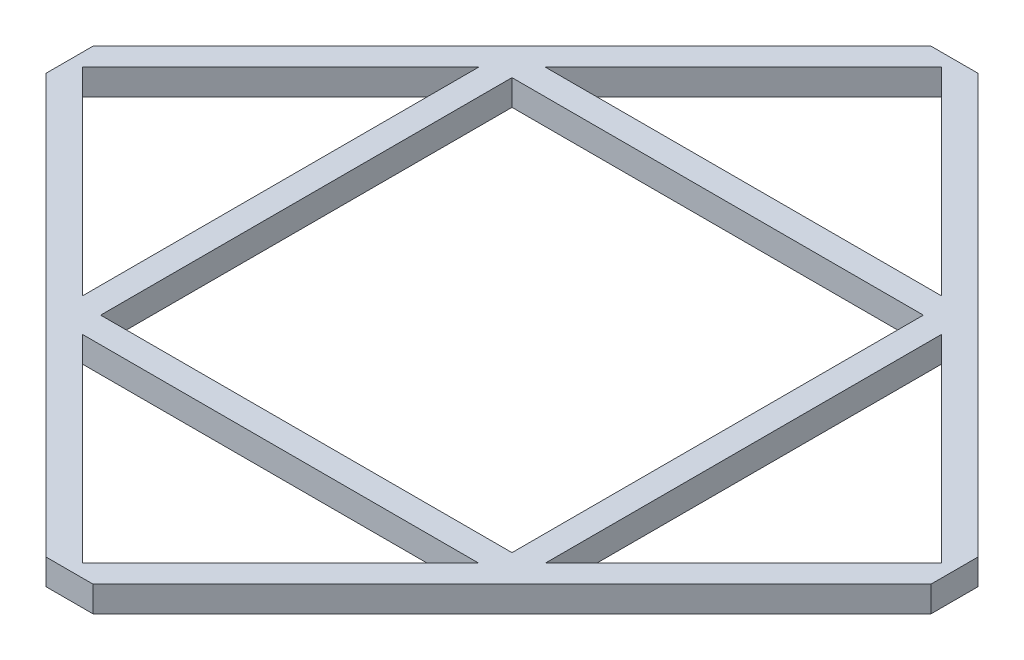
ISO-10303-21;
HEADER;
FILE_DESCRIPTION(('STEP AP214'),'2;1');
FILE_NAME('part.step','',(''),(''),'','','');
FILE_SCHEMA(('AUTOMOTIVE_DESIGN { 1 0 10303 214 1 1 1 1 }'));
ENDSEC;
DATA;
#1=APPLICATION_CONTEXT('core data for automotive mechanical design processes');
#2=APPLICATION_PROTOCOL_DEFINITION('international standard','automotive_design',2000,#1);
#3=PRODUCT_CONTEXT('',#1,'mechanical');
#4=PRODUCT('Part','Part','',(#3));
#5=PRODUCT_RELATED_PRODUCT_CATEGORY('part','',(#4));
#6=PRODUCT_DEFINITION_FORMATION('','',#4);
#7=PRODUCT_DEFINITION_CONTEXT('part definition',#1,'design');
#8=PRODUCT_DEFINITION('design','',#6,#7);
#9=PRODUCT_DEFINITION_SHAPE('','',#8);
#10=(LENGTH_UNIT() NAMED_UNIT(*) SI_UNIT(.MILLI.,.METRE.));
#11=(NAMED_UNIT(*) PLANE_ANGLE_UNIT() SI_UNIT($,.RADIAN.));
#12=(NAMED_UNIT(*) SI_UNIT($,.STERADIAN.) SOLID_ANGLE_UNIT());
#13=UNCERTAINTY_MEASURE_WITH_UNIT(LENGTH_MEASURE(1.E-05),#10,'distance_accuracy_value','');
#14=(GEOMETRIC_REPRESENTATION_CONTEXT(3) GLOBAL_UNCERTAINTY_ASSIGNED_CONTEXT((#13)) GLOBAL_UNIT_ASSIGNED_CONTEXT((#10,
#11,#12)) REPRESENTATION_CONTEXT('',''));
#15=CARTESIAN_POINT('',(0.,0.,0.));
#16=DIRECTION('',(0.,0.,1.));
#17=DIRECTION('',(1.,0.,0.));
#18=AXIS2_PLACEMENT_3D('',#15,#16,#17);
#19=CARTESIAN_POINT('',(-3618.34271247462,400.,-3618.34271247462));
#20=DIRECTION('',(-0.707106781186547,0.,-0.707106781186548));
#21=DIRECTION('',(-0.707106781186548,0.,0.707106781186547));
#22=AXIS2_PLACEMENT_3D('',#19,#20,#21);
#23=PLANE('',#22);
#24=DIRECTION('',(0.707106781186548,0.,-0.707106781186547));
#25=VECTOR('',#24,1.);
#26=CARTESIAN_POINT('',(-3618.34271247462,0.,-3618.34271247462));
#27=LINE('',#26,#25);
#28=CARTESIAN_POINT('',(-6871.,0.,-365.685424949239));
#29=VERTEX_POINT('',#28);
#30=CARTESIAN_POINT('',(-365.685424949248,0.,-6870.99999999999));
#31=VERTEX_POINT('',#30);
#32=EDGE_CURVE('E280',#29,#31,#27,.T.);
#33=ORIENTED_EDGE('',*,*,#32,.F.);
#34=DIRECTION('',(0.,-1.,0.));
#35=VECTOR('',#34,1.);
#36=CARTESIAN_POINT('',(-6871.,400.,-365.685424949239));
#37=LINE('',#36,#35);
#38=CARTESIAN_POINT('',(-6871.,400.,-365.685424949239));
#39=VERTEX_POINT('',#38);
#40=EDGE_CURVE('E11',#39,#29,#37,.T.);
#41=ORIENTED_EDGE('',*,*,#40,.F.);
#42=DIRECTION('',(0.707106781186548,0.,-0.707106781186547));
#43=VECTOR('',#42,1.);
#44=CARTESIAN_POINT('',(-3618.34271247462,400.,-3618.34271247462));
#45=LINE('',#44,#43);
#46=CARTESIAN_POINT('',(-365.685424949248,400.,-6870.99999999999));
#47=VERTEX_POINT('',#46);
#48=EDGE_CURVE('E474',#39,#47,#45,.T.);
#49=ORIENTED_EDGE('',*,*,#48,.T.);
#50=DIRECTION('',(0.,-1.,0.));
#51=VECTOR('',#50,1.);
#52=CARTESIAN_POINT('',(-365.685424949248,400.,-6870.99999999999));
#53=LINE('',#52,#51);
#54=EDGE_CURVE('E54',#47,#31,#53,.T.);
#55=ORIENTED_EDGE('',*,*,#54,.T.);
#56=EDGE_LOOP('',(#33,#41,#49,#55));
#57=FACE_BOUND('',#56,.T.);
#58=ADVANCED_FACE('F35',(#57),#23,.T.);
#59=CARTESIAN_POINT('',(-6871.,400.,1.66883159825324E-11));
#60=DIRECTION('',(1.,0.,0.));
#61=DIRECTION('',(0.,0.,-1.));
#62=AXIS2_PLACEMENT_3D('',#59,#60,#61);
#63=PLANE('',#62);
#64=DIRECTION('',(0.,0.,1.));
#65=VECTOR('',#64,1.);
#66=CARTESIAN_POINT('',(-6871.,0.,1.66883159825324E-11));
#67=LINE('',#66,#65);
#68=CARTESIAN_POINT('',(-6871.,0.,365.685424949242));
#69=VERTEX_POINT('',#68);
#70=EDGE_CURVE('E282',#29,#69,#67,.T.);
#71=ORIENTED_EDGE('',*,*,#70,.T.);
#72=DIRECTION('',(0.,-1.,0.));
#73=VECTOR('',#72,1.);
#74=CARTESIAN_POINT('',(-6871.,400.,365.685424949242));
#75=LINE('',#74,#73);
#76=CARTESIAN_POINT('',(-6871.,400.,365.685424949242));
#77=VERTEX_POINT('',#76);
#78=EDGE_CURVE('E45',#77,#69,#75,.T.);
#79=ORIENTED_EDGE('',*,*,#78,.F.);
#80=DIRECTION('',(0.,0.,1.));
#81=VECTOR('',#80,1.);
#82=CARTESIAN_POINT('',(-6871.,400.,1.66883159825324E-11));
#83=LINE('',#82,#81);
#84=EDGE_CURVE('E476',#39,#77,#83,.T.);
#85=ORIENTED_EDGE('',*,*,#84,.F.);
#86=ORIENTED_EDGE('',*,*,#40,.T.);
#87=EDGE_LOOP('',(#71,#79,#85,#86));
#88=FACE_BOUND('',#87,.T.);
#89=ADVANCED_FACE('F368',(#88),#63,.F.);
#90=CARTESIAN_POINT('',(-3618.34271247462,400.,3618.34271247462));
#91=DIRECTION('',(-0.707106781186548,0.,0.707106781186548));
#92=DIRECTION('',(0.707106781186548,0.,0.707106781186548));
#93=AXIS2_PLACEMENT_3D('',#90,#91,#92);
#94=PLANE('',#93);
#95=DIRECTION('',(-0.707106781186548,0.,-0.707106781186548));
#96=VECTOR('',#95,1.);
#97=CARTESIAN_POINT('',(-3618.34271247462,0.,3618.34271247462));
#98=LINE('',#97,#96);
#99=CARTESIAN_POINT('',(-365.685424949251,0.,6870.99999999999));
#100=VERTEX_POINT('',#99);
#101=EDGE_CURVE('E285',#100,#69,#98,.T.);
#102=ORIENTED_EDGE('',*,*,#101,.F.);
#103=DIRECTION('',(0.,-1.,0.));
#104=VECTOR('',#103,1.);
#105=CARTESIAN_POINT('',(-365.685424949251,400.,6870.99999999999));
#106=LINE('',#105,#104);
#107=CARTESIAN_POINT('',(-365.685424949251,400.,6870.99999999999));
#108=VERTEX_POINT('',#107);
#109=EDGE_CURVE('E308',#108,#100,#106,.T.);
#110=ORIENTED_EDGE('',*,*,#109,.F.);
#111=DIRECTION('',(-0.707106781186548,0.,-0.707106781186548));
#112=VECTOR('',#111,1.);
#113=CARTESIAN_POINT('',(-3618.34271247462,400.,3618.34271247462));
#114=LINE('',#113,#112);
#115=EDGE_CURVE('E478',#108,#77,#114,.T.);
#116=ORIENTED_EDGE('',*,*,#115,.T.);
#117=ORIENTED_EDGE('',*,*,#78,.T.);
#118=EDGE_LOOP('',(#102,#110,#116,#117));
#119=FACE_BOUND('',#118,.T.);
#120=ADVANCED_FACE('F373',(#119),#94,.T.);
#121=CARTESIAN_POINT('',(-8.34415799126599E-12,400.,6870.99999999999));
#122=DIRECTION('',(0.,0.,-1.));
#123=DIRECTION('',(-1.,0.,0.));
#124=AXIS2_PLACEMENT_3D('',#121,#122,#123);
#125=PLANE('',#124);
#126=DIRECTION('',(1.,0.,0.));
#127=VECTOR('',#126,1.);
#128=CARTESIAN_POINT('',(-8.34415799126599E-12,0.,6870.99999999999));
#129=LINE('',#128,#127);
#130=CARTESIAN_POINT('',(365.685424949249,0.,6870.99999999999));
#131=VERTEX_POINT('',#130);
#132=EDGE_CURVE('E288',#100,#131,#129,.T.);
#133=ORIENTED_EDGE('',*,*,#132,.T.);
#134=DIRECTION('',(0.,-1.,0.));
#135=VECTOR('',#134,1.);
#136=CARTESIAN_POINT('',(365.685424949249,400.,6870.99999999999));
#137=LINE('',#136,#135);
#138=CARTESIAN_POINT('',(365.685424949249,400.,6870.99999999999));
#139=VERTEX_POINT('',#138);
#140=EDGE_CURVE('E305',#139,#131,#137,.T.);
#141=ORIENTED_EDGE('',*,*,#140,.F.);
#142=DIRECTION('',(1.,0.,0.));
#143=VECTOR('',#142,1.);
#144=CARTESIAN_POINT('',(-8.34415799126599E-12,400.,6870.99999999999));
#145=LINE('',#144,#143);
#146=EDGE_CURVE('E227',#108,#139,#145,.T.);
#147=ORIENTED_EDGE('',*,*,#146,.F.);
#148=ORIENTED_EDGE('',*,*,#109,.T.);
#149=EDGE_LOOP('',(#133,#141,#147,#148));
#150=FACE_BOUND('',#149,.T.);
#151=ADVANCED_FACE('F484',(#150),#125,.F.);
#152=CARTESIAN_POINT('',(3618.34271247462,400.,3618.34271247462));
#153=DIRECTION('',(-0.707106781186547,0.,-0.707106781186548));
#154=DIRECTION('',(-0.707106781186548,0.,0.707106781186547));
#155=AXIS2_PLACEMENT_3D('',#152,#153,#154);
#156=PLANE('',#155);
#157=DIRECTION('',(0.707106781186548,0.,-0.707106781186547));
#158=VECTOR('',#157,1.);
#159=CARTESIAN_POINT('',(3618.34271247462,0.,3618.34271247462));
#160=LINE('',#159,#158);
#161=CARTESIAN_POINT('',(6871.,0.,365.685424949239));
#162=VERTEX_POINT('',#161);
#163=EDGE_CURVE('E291',#131,#162,#160,.T.);
#164=ORIENTED_EDGE('',*,*,#163,.T.);
#165=DIRECTION('',(0.,-1.,0.));
#166=VECTOR('',#165,1.);
#167=CARTESIAN_POINT('',(6871.,400.,365.685424949239));
#168=LINE('',#167,#166);
#169=CARTESIAN_POINT('',(6871.,400.,365.685424949239));
#170=VERTEX_POINT('',#169);
#171=EDGE_CURVE('E213',#170,#162,#168,.T.);
#172=ORIENTED_EDGE('',*,*,#171,.F.);
#173=DIRECTION('',(0.707106781186548,0.,-0.707106781186547));
#174=VECTOR('',#173,1.);
#175=CARTESIAN_POINT('',(3618.34271247462,400.,3618.34271247462));
#176=LINE('',#175,#174);
#177=EDGE_CURVE('E224',#139,#170,#176,.T.);
#178=ORIENTED_EDGE('',*,*,#177,.F.);
#179=ORIENTED_EDGE('',*,*,#140,.T.);
#180=EDGE_LOOP('',(#164,#172,#178,#179));
#181=FACE_BOUND('',#180,.T.);
#182=ADVANCED_FACE('F487',(#181),#156,.F.);
#183=CARTESIAN_POINT('',(6871.,400.,-1.66883159825326E-11));
#184=DIRECTION('',(1.,0.,0.));
#185=DIRECTION('',(0.,0.,-1.));
#186=AXIS2_PLACEMENT_3D('',#183,#184,#185);
#187=PLANE('',#186);
#188=DIRECTION('',(0.,0.,1.));
#189=VECTOR('',#188,1.);
#190=CARTESIAN_POINT('',(6871.,0.,-1.66883159825326E-11));
#191=LINE('',#190,#189);
#192=CARTESIAN_POINT('',(6871.,0.,-365.685424949237));
#193=VERTEX_POINT('',#192);
#194=EDGE_CURVE('E210',#193,#162,#191,.T.);
#195=ORIENTED_EDGE('',*,*,#194,.F.);
#196=DIRECTION('',(0.,-1.,0.));
#197=VECTOR('',#196,1.);
#198=CARTESIAN_POINT('',(6871.,400.,-365.685424949237));
#199=LINE('',#198,#197);
#200=CARTESIAN_POINT('',(6871.,400.,-365.685424949237));
#201=VERTEX_POINT('',#200);
#202=EDGE_CURVE('E204',#201,#193,#199,.T.);
#203=ORIENTED_EDGE('',*,*,#202,.F.);
#204=DIRECTION('',(0.,0.,1.));
#205=VECTOR('',#204,1.);
#206=CARTESIAN_POINT('',(6871.,400.,-1.66883159825326E-11));
#207=LINE('',#206,#205);
#208=EDGE_CURVE('E208',#201,#170,#207,.T.);
#209=ORIENTED_EDGE('',*,*,#208,.T.);
#210=ORIENTED_EDGE('',*,*,#171,.T.);
#211=EDGE_LOOP('',(#195,#203,#209,#210));
#212=FACE_BOUND('',#211,.T.);
#213=ADVANCED_FACE('F206',(#212),#187,.T.);
#214=CARTESIAN_POINT('',(3618.34271247462,400.,-3618.34271247462));
#215=DIRECTION('',(-0.707106781186548,0.,0.707106781186547));
#216=DIRECTION('',(0.707106781186547,0.,0.707106781186548));
#217=AXIS2_PLACEMENT_3D('',#214,#215,#216);
#218=PLANE('',#217);
#219=DIRECTION('',(-0.707106781186547,0.,-0.707106781186548));
#220=VECTOR('',#219,1.);
#221=CARTESIAN_POINT('',(3618.34271247462,0.,-3618.34271247462));
#222=LINE('',#221,#220);
#223=CARTESIAN_POINT('',(365.685424949249,0.,-6870.99999999999));
#224=VERTEX_POINT('',#223);
#225=EDGE_CURVE('E295',#193,#224,#222,.T.);
#226=ORIENTED_EDGE('',*,*,#225,.T.);
#227=DIRECTION('',(0.,-1.,0.));
#228=VECTOR('',#227,1.);
#229=CARTESIAN_POINT('',(365.685424949249,400.,-6870.99999999999));
#230=LINE('',#229,#228);
#231=CARTESIAN_POINT('',(365.685424949249,400.,-6870.99999999999));
#232=VERTEX_POINT('',#231);
#233=EDGE_CURVE('E128',#232,#224,#230,.T.);
#234=ORIENTED_EDGE('',*,*,#233,.F.);
#235=DIRECTION('',(-0.707106781186547,0.,-0.707106781186548));
#236=VECTOR('',#235,1.);
#237=CARTESIAN_POINT('',(3618.34271247462,400.,-3618.34271247462));
#238=LINE('',#237,#236);
#239=EDGE_CURVE('E215',#201,#232,#238,.T.);
#240=ORIENTED_EDGE('',*,*,#239,.F.);
#241=ORIENTED_EDGE('',*,*,#202,.T.);
#242=EDGE_LOOP('',(#226,#234,#240,#241));
#243=FACE_BOUND('',#242,.T.);
#244=ADVANCED_FACE('F216',(#243),#218,.F.);
#245=CARTESIAN_POINT('',(3335.5,400.,3335.5));
#246=DIRECTION('',(-0.707106781186548,0.,-0.707106781186547));
#247=DIRECTION('',(-0.707106781186547,0.,0.707106781186548));
#248=AXIS2_PLACEMENT_3D('',#245,#246,#247);
#249=PLANE('',#248);
#250=DIRECTION('',(0.707106781186547,0.,-0.707106781186548));
#251=VECTOR('',#250,1.);
#252=CARTESIAN_POINT('',(3335.5,0.,3335.5));
#253=LINE('',#252,#251);
#254=CARTESIAN_POINT('',(3594.0786437627,0.,3076.92135623731));
#255=VERTEX_POINT('',#254);
#256=CARTESIAN_POINT('',(6671.,0.,0.));
#257=VERTEX_POINT('',#256);
#258=EDGE_CURVE('E271',#255,#257,#253,.T.);
#259=ORIENTED_EDGE('',*,*,#258,.F.);
#260=DIRECTION('',(0.,-1.,0.));
#261=VECTOR('',#260,1.);
#262=CARTESIAN_POINT('',(3594.0786437627,400.,3076.92135623731));
#263=LINE('',#262,#261);
#264=CARTESIAN_POINT('',(3594.0786437627,400.,3076.92135623731));
#265=VERTEX_POINT('',#264);
#266=EDGE_CURVE('E302',#265,#255,#263,.T.);
#267=ORIENTED_EDGE('',*,*,#266,.F.);
#268=DIRECTION('',(0.707106781186547,0.,-0.707106781186548));
#269=VECTOR('',#268,1.);
#270=CARTESIAN_POINT('',(3335.5,400.,3335.5));
#271=LINE('',#270,#269);
#272=CARTESIAN_POINT('',(6671.,400.,0.));
#273=VERTEX_POINT('',#272);
#274=EDGE_CURVE('E466',#265,#273,#271,.T.);
#275=ORIENTED_EDGE('',*,*,#274,.T.);
#276=DIRECTION('',(0.,-1.,0.));
#277=VECTOR('',#276,1.);
#278=CARTESIAN_POINT('',(6671.,400.,0.));
#279=LINE('',#278,#277);
#280=EDGE_CURVE('E311',#273,#257,#279,.T.);
#281=ORIENTED_EDGE('',*,*,#280,.T.);
#282=EDGE_LOOP('',(#259,#267,#275,#281));
#283=FACE_BOUND('',#282,.T.);
#284=ADVANCED_FACE('F387',(#283),#249,.T.);
#285=CARTESIAN_POINT('',(3594.0786437627,400.,2.59365021113082E-13));
#286=DIRECTION('',(-1.,0.,0.));
#287=DIRECTION('',(0.,0.,1.));
#288=AXIS2_PLACEMENT_3D('',#285,#286,#287);
#289=PLANE('',#288);
#290=DIRECTION('',(0.,0.,-1.));
#291=VECTOR('',#290,1.);
#292=CARTESIAN_POINT('',(3594.0786437627,0.,2.59365021113082E-13));
#293=LINE('',#292,#291);
#294=CARTESIAN_POINT('',(3594.0786437627,0.,-3076.9213562373));
#295=VERTEX_POINT('',#294);
#296=EDGE_CURVE('E274',#255,#295,#293,.T.);
#297=ORIENTED_EDGE('',*,*,#296,.T.);
#298=DIRECTION('',(0.,-1.,0.));
#299=VECTOR('',#298,1.);
#300=CARTESIAN_POINT('',(3594.0786437627,400.,-3076.9213562373));
#301=LINE('',#300,#299);
#302=CARTESIAN_POINT('',(3594.0786437627,400.,-3076.9213562373));
#303=VERTEX_POINT('',#302);
#304=EDGE_CURVE('E313',#303,#295,#301,.T.);
#305=ORIENTED_EDGE('',*,*,#304,.F.);
#306=DIRECTION('',(0.,0.,-1.));
#307=VECTOR('',#306,1.);
#308=CARTESIAN_POINT('',(3594.0786437627,400.,2.59365021113082E-13));
#309=LINE('',#308,#307);
#310=EDGE_CURVE('E469',#265,#303,#309,.T.);
#311=ORIENTED_EDGE('',*,*,#310,.F.);
#312=ORIENTED_EDGE('',*,*,#266,.T.);
#313=EDGE_LOOP('',(#297,#305,#311,#312));
#314=FACE_BOUND('',#313,.T.);
#315=ADVANCED_FACE('F383',(#314),#289,.F.);
#316=CARTESIAN_POINT('',(3194.0786437627,400.,0.));
#317=DIRECTION('',(-1.,0.,0.));
#318=DIRECTION('',(0.,0.,1.));
#319=AXIS2_PLACEMENT_3D('',#316,#317,#318);
#320=PLANE('',#319);
#321=DIRECTION('',(0.,0.,-1.));
#322=VECTOR('',#321,1.);
#323=CARTESIAN_POINT('',(3194.0786437627,0.,0.));
#324=LINE('',#323,#322);
#325=CARTESIAN_POINT('',(3194.0786437627,0.,3194.0786437627));
#326=VERTEX_POINT('',#325);
#327=CARTESIAN_POINT('',(3194.0786437627,0.,-3194.0786437627));
#328=VERTEX_POINT('',#327);
#329=EDGE_CURVE('E259',#326,#328,#324,.T.);
#330=ORIENTED_EDGE('',*,*,#329,.F.);
#331=DIRECTION('',(0.,-1.,0.));
#332=VECTOR('',#331,1.);
#333=CARTESIAN_POINT('',(3194.0786437627,400.,3194.0786437627));
#334=LINE('',#333,#332);
#335=CARTESIAN_POINT('',(3194.0786437627,400.,3194.0786437627));
#336=VERTEX_POINT('',#335);
#337=EDGE_CURVE('E314',#336,#326,#334,.T.);
#338=ORIENTED_EDGE('',*,*,#337,.F.);
#339=DIRECTION('',(0.,0.,-1.));
#340=VECTOR('',#339,1.);
#341=CARTESIAN_POINT('',(3194.0786437627,400.,0.));
#342=LINE('',#341,#340);
#343=CARTESIAN_POINT('',(3194.0786437627,400.,-3194.0786437627));
#344=VERTEX_POINT('',#343);
#345=EDGE_CURVE('E455',#336,#344,#342,.T.);
#346=ORIENTED_EDGE('',*,*,#345,.T.);
#347=DIRECTION('',(0.,-1.,0.));
#348=VECTOR('',#347,1.);
#349=CARTESIAN_POINT('',(3194.0786437627,400.,-3194.0786437627));
#350=LINE('',#349,#348);
#351=EDGE_CURVE('E317',#344,#328,#350,.T.);
#352=ORIENTED_EDGE('',*,*,#351,.T.);
#353=EDGE_LOOP('',(#330,#338,#346,#352));
#354=FACE_BOUND('',#353,.T.);
#355=ADVANCED_FACE('F386',(#354),#320,.T.);
#356=CARTESIAN_POINT('',(0.,400.,3194.0786437627));
#357=DIRECTION('',(0.,0.,-1.));
#358=DIRECTION('',(-1.,0.,0.));
#359=AXIS2_PLACEMENT_3D('',#356,#357,#358);
#360=PLANE('',#359);
#361=DIRECTION('',(1.,0.,0.));
#362=VECTOR('',#361,1.);
#363=CARTESIAN_POINT('',(0.,0.,3194.0786437627));
#364=LINE('',#363,#362);
#365=CARTESIAN_POINT('',(-3194.0786437627,0.,3194.0786437627));
#366=VERTEX_POINT('',#365);
#367=EDGE_CURVE('E262',#366,#326,#364,.T.);
#368=ORIENTED_EDGE('',*,*,#367,.F.);
#369=DIRECTION('',(0.,-1.,0.));
#370=VECTOR('',#369,1.);
#371=CARTESIAN_POINT('',(-3194.0786437627,400.,3194.0786437627));
#372=LINE('',#371,#370);
#373=CARTESIAN_POINT('',(-3194.0786437627,400.,3194.0786437627));
#374=VERTEX_POINT('',#373);
#375=EDGE_CURVE('E323',#374,#366,#372,.T.);
#376=ORIENTED_EDGE('',*,*,#375,.F.);
#377=DIRECTION('',(1.,0.,0.));
#378=VECTOR('',#377,1.);
#379=CARTESIAN_POINT('',(0.,400.,3194.0786437627));
#380=LINE('',#379,#378);
#381=EDGE_CURVE('E458',#374,#336,#380,.T.);
#382=ORIENTED_EDGE('',*,*,#381,.T.);
#383=ORIENTED_EDGE('',*,*,#337,.T.);
#384=EDGE_LOOP('',(#368,#376,#382,#383));
#385=FACE_BOUND('',#384,.T.);
#386=ADVANCED_FACE('F399',(#385),#360,.T.);
#387=CARTESIAN_POINT('',(-3194.0786437627,400.,0.));
#388=DIRECTION('',(-1.,0.,0.));
#389=DIRECTION('',(0.,0.,1.));
#390=AXIS2_PLACEMENT_3D('',#387,#388,#389);
#391=PLANE('',#390);
#392=DIRECTION('',(0.,0.,-1.));
#393=VECTOR('',#392,1.);
#394=CARTESIAN_POINT('',(-3194.0786437627,0.,0.));
#395=LINE('',#394,#393);
#396=CARTESIAN_POINT('',(-3194.0786437627,0.,-3194.0786437627));
#397=VERTEX_POINT('',#396);
#398=EDGE_CURVE('E265',#366,#397,#395,.T.);
#399=ORIENTED_EDGE('',*,*,#398,.T.);
#400=DIRECTION('',(0.,-1.,0.));
#401=VECTOR('',#400,1.);
#402=CARTESIAN_POINT('',(-3194.0786437627,400.,-3194.0786437627));
#403=LINE('',#402,#401);
#404=CARTESIAN_POINT('',(-3194.0786437627,400.,-3194.0786437627));
#405=VERTEX_POINT('',#404);
#406=EDGE_CURVE('E319',#405,#397,#403,.T.);
#407=ORIENTED_EDGE('',*,*,#406,.F.);
#408=DIRECTION('',(0.,0.,-1.));
#409=VECTOR('',#408,1.);
#410=CARTESIAN_POINT('',(-3194.0786437627,400.,0.));
#411=LINE('',#410,#409);
#412=EDGE_CURVE('E461',#374,#405,#411,.T.);
#413=ORIENTED_EDGE('',*,*,#412,.F.);
#414=ORIENTED_EDGE('',*,*,#375,.T.);
#415=EDGE_LOOP('',(#399,#407,#413,#414));
#416=FACE_BOUND('',#415,.T.);
#417=ADVANCED_FACE('F395',(#416),#391,.F.);
#418=CARTESIAN_POINT('',(-3335.5,400.,3335.5));
#419=DIRECTION('',(-0.707106781186548,0.,0.707106781186547));
#420=DIRECTION('',(0.707106781186547,0.,0.707106781186548));
#421=AXIS2_PLACEMENT_3D('',#418,#419,#420);
#422=PLANE('',#421);
#423=DIRECTION('',(-0.707106781186547,0.,-0.707106781186548));
#424=VECTOR('',#423,1.);
#425=CARTESIAN_POINT('',(-3335.5,0.,3335.5));
#426=LINE('',#425,#424);
#427=CARTESIAN_POINT('',(4.44089209850063E-13,0.,6671.));
#428=VERTEX_POINT('',#427);
#429=CARTESIAN_POINT('',(-3076.9213562373,0.,3594.0786437627));
#430=VERTEX_POINT('',#429);
#431=EDGE_CURVE('E250',#428,#430,#426,.T.);
#432=ORIENTED_EDGE('',*,*,#431,.T.);
#433=DIRECTION('',(0.,-1.,0.));
#434=VECTOR('',#433,1.);
#435=CARTESIAN_POINT('',(-3076.9213562373,400.,3594.0786437627));
#436=LINE('',#435,#434);
#437=CARTESIAN_POINT('',(-3076.9213562373,400.,3594.0786437627));
#438=VERTEX_POINT('',#437);
#439=EDGE_CURVE('E320',#438,#430,#436,.T.);
#440=ORIENTED_EDGE('',*,*,#439,.F.);
#441=DIRECTION('',(-0.707106781186547,0.,-0.707106781186548));
#442=VECTOR('',#441,1.);
#443=CARTESIAN_POINT('',(-3335.5,400.,3335.5));
#444=LINE('',#443,#442);
#445=CARTESIAN_POINT('',(4.44089209850063E-13,400.,6671.));
#446=VERTEX_POINT('',#445);
#447=EDGE_CURVE('E447',#446,#438,#444,.T.);
#448=ORIENTED_EDGE('',*,*,#447,.F.);
#449=DIRECTION('',(0.,-1.,0.));
#450=VECTOR('',#449,1.);
#451=CARTESIAN_POINT('',(4.44089209850063E-13,400.,6671.));
#452=LINE('',#451,#450);
#453=EDGE_CURVE('E326',#446,#428,#452,.T.);
#454=ORIENTED_EDGE('',*,*,#453,.T.);
#455=EDGE_LOOP('',(#432,#440,#448,#454));
#456=FACE_BOUND('',#455,.T.);
#457=ADVANCED_FACE('F398',(#456),#422,.F.);
#458=CARTESIAN_POINT('',(0.,400.,3594.0786437627));
#459=DIRECTION('',(0.,0.,-1.));
#460=DIRECTION('',(-1.,0.,0.));
#461=AXIS2_PLACEMENT_3D('',#458,#459,#460);
#462=PLANE('',#461);
#463=DIRECTION('',(1.,0.,0.));
#464=VECTOR('',#463,1.);
#465=CARTESIAN_POINT('',(0.,0.,3594.0786437627));
#466=LINE('',#465,#464);
#467=CARTESIAN_POINT('',(3076.92135623731,0.,3594.0786437627));
#468=VERTEX_POINT('',#467);
#469=EDGE_CURVE('E253',#430,#468,#466,.T.);
#470=ORIENTED_EDGE('',*,*,#469,.T.);
#471=DIRECTION('',(0.,-1.,0.));
#472=VECTOR('',#471,1.);
#473=CARTESIAN_POINT('',(3076.92135623731,400.,3594.0786437627));
#474=LINE('',#473,#472);
#475=CARTESIAN_POINT('',(3076.92135623731,400.,3594.0786437627));
#476=VERTEX_POINT('',#475);
#477=EDGE_CURVE('E328',#476,#468,#474,.T.);
#478=ORIENTED_EDGE('',*,*,#477,.F.);
#479=DIRECTION('',(1.,0.,0.));
#480=VECTOR('',#479,1.);
#481=CARTESIAN_POINT('',(0.,400.,3594.0786437627));
#482=LINE('',#481,#480);
#483=EDGE_CURVE('E450',#438,#476,#482,.T.);
#484=ORIENTED_EDGE('',*,*,#483,.F.);
#485=ORIENTED_EDGE('',*,*,#439,.T.);
#486=EDGE_LOOP('',(#470,#478,#484,#485));
#487=FACE_BOUND('',#486,.T.);
#488=ADVANCED_FACE('F410',(#487),#462,.F.);
#489=CARTESIAN_POINT('',(2.59365021113081E-13,400.,-3594.0786437627));
#490=DIRECTION('',(0.,0.,-1.));
#491=DIRECTION('',(-1.,0.,0.));
#492=AXIS2_PLACEMENT_3D('',#489,#490,#491);
#493=PLANE('',#492);
#494=DIRECTION('',(1.,0.,0.));
#495=VECTOR('',#494,1.);
#496=CARTESIAN_POINT('',(2.59365021113081E-13,0.,-3594.0786437627));
#497=LINE('',#496,#495);
#498=CARTESIAN_POINT('',(-3076.92135623731,0.,-3594.0786437627));
#499=VERTEX_POINT('',#498);
#500=CARTESIAN_POINT('',(3076.92135623731,0.,-3594.0786437627));
#501=VERTEX_POINT('',#500);
#502=EDGE_CURVE('E241',#499,#501,#497,.T.);
#503=ORIENTED_EDGE('',*,*,#502,.F.);
#504=DIRECTION('',(0.,-1.,0.));
#505=VECTOR('',#504,1.);
#506=CARTESIAN_POINT('',(-3076.92135623731,400.,-3594.0786437627));
#507=LINE('',#506,#505);
#508=CARTESIAN_POINT('',(-3076.92135623731,400.,-3594.0786437627));
#509=VERTEX_POINT('',#508);
#510=EDGE_CURVE('E329',#509,#499,#507,.T.);
#511=ORIENTED_EDGE('',*,*,#510,.F.);
#512=DIRECTION('',(1.,0.,0.));
#513=VECTOR('',#512,1.);
#514=CARTESIAN_POINT('',(2.59365021113081E-13,400.,-3594.0786437627));
#515=LINE('',#514,#513);
#516=CARTESIAN_POINT('',(3076.92135623731,400.,-3594.0786437627));
#517=VERTEX_POINT('',#516);
#518=EDGE_CURVE('E438',#509,#517,#515,.T.);
#519=ORIENTED_EDGE('',*,*,#518,.T.);
#520=DIRECTION('',(0.,-1.,0.));
#521=VECTOR('',#520,1.);
#522=CARTESIAN_POINT('',(3076.92135623731,400.,-3594.0786437627));
#523=LINE('',#522,#521);
#524=EDGE_CURVE('E333',#517,#501,#523,.T.);
#525=ORIENTED_EDGE('',*,*,#524,.T.);
#526=EDGE_LOOP('',(#503,#511,#519,#525));
#527=FACE_BOUND('',#526,.T.);
#528=ADVANCED_FACE('F413',(#527),#493,.T.);
#529=CARTESIAN_POINT('',(-3335.5,400.,-3335.5));
#530=DIRECTION('',(-0.707106781186548,0.,-0.707106781186548));
#531=DIRECTION('',(-0.707106781186548,0.,0.707106781186548));
#532=AXIS2_PLACEMENT_3D('',#529,#530,#531);
#533=PLANE('',#532);
#534=DIRECTION('',(0.707106781186548,0.,-0.707106781186548));
#535=VECTOR('',#534,1.);
#536=CARTESIAN_POINT('',(-3335.5,0.,-3335.5));
#537=LINE('',#536,#535);
#538=CARTESIAN_POINT('',(1.33226762955019E-12,0.,-6671.));
#539=VERTEX_POINT('',#538);
#540=EDGE_CURVE('E244',#499,#539,#537,.T.);
#541=ORIENTED_EDGE('',*,*,#540,.T.);
#542=DIRECTION('',(0.,-1.,0.));
#543=VECTOR('',#542,1.);
#544=CARTESIAN_POINT('',(1.33226762955019E-12,400.,-6671.));
#545=LINE('',#544,#543);
#546=CARTESIAN_POINT('',(1.33226762955019E-12,400.,-6671.));
#547=VERTEX_POINT('',#546);
#548=EDGE_CURVE('E335',#547,#539,#545,.T.);
#549=ORIENTED_EDGE('',*,*,#548,.F.);
#550=DIRECTION('',(0.707106781186548,0.,-0.707106781186548));
#551=VECTOR('',#550,1.);
#552=CARTESIAN_POINT('',(-3335.5,400.,-3335.5));
#553=LINE('',#552,#551);
#554=EDGE_CURVE('E435',#509,#547,#553,.T.);
#555=ORIENTED_EDGE('',*,*,#554,.F.);
#556=ORIENTED_EDGE('',*,*,#510,.T.);
#557=EDGE_LOOP('',(#541,#549,#555,#556));
#558=FACE_BOUND('',#557,.T.);
#559=ADVANCED_FACE('F418',(#558),#533,.F.);
#560=CARTESIAN_POINT('',(-3594.0786437627,400.,2.59365021113081E-13));
#561=DIRECTION('',(-1.,0.,0.));
#562=DIRECTION('',(0.,0.,1.));
#563=AXIS2_PLACEMENT_3D('',#560,#561,#562);
#564=PLANE('',#563);
#565=DIRECTION('',(0.,0.,-1.));
#566=VECTOR('',#565,1.);
#567=CARTESIAN_POINT('',(-3594.0786437627,0.,2.59365021113081E-13));
#568=LINE('',#567,#566);
#569=CARTESIAN_POINT('',(-3594.0786437627,0.,3076.92135623731));
#570=VERTEX_POINT('',#569);
#571=CARTESIAN_POINT('',(-3594.0786437627,0.,-3076.92135623731));
#572=VERTEX_POINT('',#571);
#573=EDGE_CURVE('E233',#570,#572,#568,.T.);
#574=ORIENTED_EDGE('',*,*,#573,.F.);
#575=DIRECTION('',(0.,-1.,0.));
#576=VECTOR('',#575,1.);
#577=CARTESIAN_POINT('',(-3594.0786437627,400.,3076.92135623731));
#578=LINE('',#577,#576);
#579=CARTESIAN_POINT('',(-3594.0786437627,400.,3076.92135623731));
#580=VERTEX_POINT('',#579);
#581=EDGE_CURVE('E39',#580,#570,#578,.T.);
#582=ORIENTED_EDGE('',*,*,#581,.F.);
#583=DIRECTION('',(0.,0.,-1.));
#584=VECTOR('',#583,1.);
#585=CARTESIAN_POINT('',(-3594.0786437627,400.,2.59365021113081E-13));
#586=LINE('',#585,#584);
#587=CARTESIAN_POINT('',(-3594.0786437627,400.,-3076.92135623731));
#588=VERTEX_POINT('',#587);
#589=EDGE_CURVE('E300',#580,#588,#586,.T.);
#590=ORIENTED_EDGE('',*,*,#589,.T.);
#591=DIRECTION('',(0.,-1.,0.));
#592=VECTOR('',#591,1.);
#593=CARTESIAN_POINT('',(-3594.0786437627,400.,-3076.92135623731));
#594=LINE('',#593,#592);
#595=EDGE_CURVE('E232',#588,#572,#594,.T.);
#596=ORIENTED_EDGE('',*,*,#595,.T.);
#597=EDGE_LOOP('',(#574,#582,#590,#596));
#598=FACE_BOUND('',#597,.T.);
#599=ADVANCED_FACE('F37',(#598),#564,.T.);
#600=CARTESIAN_POINT('',(-3335.5,400.,3335.5));
#601=DIRECTION('',(-0.707106781186548,0.,0.707106781186548));
#602=DIRECTION('',(0.707106781186548,0.,0.707106781186548));
#603=AXIS2_PLACEMENT_3D('',#600,#601,#602);
#604=PLANE('',#603);
#605=DIRECTION('',(-0.707106781186548,0.,-0.707106781186548));
#606=VECTOR('',#605,1.);
#607=CARTESIAN_POINT('',(-3335.5,0.,3335.5));
#608=LINE('',#607,#606);
#609=CARTESIAN_POINT('',(-6671.,0.,-4.44089209850063E-13));
#610=VERTEX_POINT('',#609);
#611=EDGE_CURVE('E236',#570,#610,#608,.T.);
#612=ORIENTED_EDGE('',*,*,#611,.T.);
#613=DIRECTION('',(0.,-1.,0.));
#614=VECTOR('',#613,1.);
#615=CARTESIAN_POINT('',(-6671.,400.,-4.44089209850063E-13));
#616=LINE('',#615,#614);
#617=CARTESIAN_POINT('',(-6671.,400.,-4.44089209850063E-13));
#618=VERTEX_POINT('',#617);
#619=EDGE_CURVE('E338',#618,#610,#616,.T.);
#620=ORIENTED_EDGE('',*,*,#619,.F.);
#621=DIRECTION('',(-0.707106781186548,0.,-0.707106781186548));
#622=VECTOR('',#621,1.);
#623=CARTESIAN_POINT('',(-3335.5,400.,3335.5));
#624=LINE('',#623,#622);
#625=EDGE_CURVE('E347',#580,#618,#624,.T.);
#626=ORIENTED_EDGE('',*,*,#625,.F.);
#627=ORIENTED_EDGE('',*,*,#581,.T.);
#628=EDGE_LOOP('',(#612,#620,#626,#627));
#629=FACE_BOUND('',#628,.T.);
#630=ADVANCED_FACE('F346',(#629),#604,.F.);
#631=CARTESIAN_POINT('',(3335.5,400.,-3335.5));
#632=DIRECTION('',(-0.707106781186548,0.,0.707106781186548));
#633=DIRECTION('',(0.707106781186548,0.,0.707106781186548));
#634=AXIS2_PLACEMENT_3D('',#631,#632,#633);
#635=PLANE('',#634);
#636=DIRECTION('',(-0.707106781186548,0.,-0.707106781186548));
#637=VECTOR('',#636,1.);
#638=CARTESIAN_POINT('',(3335.5,0.,-3335.5));
#639=LINE('',#638,#637);
#640=EDGE_CURVE('E277',#257,#295,#639,.T.);
#641=ORIENTED_EDGE('',*,*,#640,.F.);
#642=ORIENTED_EDGE('',*,*,#280,.F.);
#643=DIRECTION('',(-0.707106781186548,0.,-0.707106781186548));
#644=VECTOR('',#643,1.);
#645=CARTESIAN_POINT('',(3335.5,400.,-3335.5));
#646=LINE('',#645,#644);
#647=EDGE_CURVE('E471',#273,#303,#646,.T.);
#648=ORIENTED_EDGE('',*,*,#647,.T.);
#649=ORIENTED_EDGE('',*,*,#304,.T.);
#650=EDGE_LOOP('',(#641,#642,#648,#649));
#651=FACE_BOUND('',#650,.T.);
#652=ADVANCED_FACE('F378',(#651),#635,.T.);
#653=CARTESIAN_POINT('',(0.,400.,-3194.0786437627));
#654=DIRECTION('',(0.,0.,-1.));
#655=DIRECTION('',(-1.,0.,0.));
#656=AXIS2_PLACEMENT_3D('',#653,#654,#655);
#657=PLANE('',#656);
#658=DIRECTION('',(1.,0.,0.));
#659=VECTOR('',#658,1.);
#660=CARTESIAN_POINT('',(0.,0.,-3194.0786437627));
#661=LINE('',#660,#659);
#662=EDGE_CURVE('E268',#397,#328,#661,.T.);
#663=ORIENTED_EDGE('',*,*,#662,.T.);
#664=ORIENTED_EDGE('',*,*,#351,.F.);
#665=DIRECTION('',(1.,0.,0.));
#666=VECTOR('',#665,1.);
#667=CARTESIAN_POINT('',(0.,400.,-3194.0786437627));
#668=LINE('',#667,#666);
#669=EDGE_CURVE('E464',#405,#344,#668,.T.);
#670=ORIENTED_EDGE('',*,*,#669,.F.);
#671=ORIENTED_EDGE('',*,*,#406,.T.);
#672=EDGE_LOOP('',(#663,#664,#670,#671));
#673=FACE_BOUND('',#672,.T.);
#674=ADVANCED_FACE('F381',(#673),#657,.F.);
#675=CARTESIAN_POINT('',(3335.5,400.,3335.5));
#676=DIRECTION('',(-0.707106781186547,0.,-0.707106781186548));
#677=DIRECTION('',(-0.707106781186548,0.,0.707106781186547));
#678=AXIS2_PLACEMENT_3D('',#675,#676,#677);
#679=PLANE('',#678);
#680=DIRECTION('',(0.707106781186548,0.,-0.707106781186547));
#681=VECTOR('',#680,1.);
#682=CARTESIAN_POINT('',(3335.5,0.,3335.5));
#683=LINE('',#682,#681);
#684=EDGE_CURVE('E256',#428,#468,#683,.T.);
#685=ORIENTED_EDGE('',*,*,#684,.F.);
#686=ORIENTED_EDGE('',*,*,#453,.F.);
#687=DIRECTION('',(0.707106781186548,0.,-0.707106781186547));
#688=VECTOR('',#687,1.);
#689=CARTESIAN_POINT('',(3335.5,400.,3335.5));
#690=LINE('',#689,#688);
#691=EDGE_CURVE('E452',#446,#476,#690,.T.);
#692=ORIENTED_EDGE('',*,*,#691,.T.);
#693=ORIENTED_EDGE('',*,*,#477,.T.);
#694=EDGE_LOOP('',(#685,#686,#692,#693));
#695=FACE_BOUND('',#694,.T.);
#696=ADVANCED_FACE('F363',(#695),#679,.T.);
#697=CARTESIAN_POINT('',(3335.5,400.,-3335.5));
#698=DIRECTION('',(-0.707106781186548,0.,0.707106781186548));
#699=DIRECTION('',(0.707106781186548,0.,0.707106781186548));
#700=AXIS2_PLACEMENT_3D('',#697,#698,#699);
#701=PLANE('',#700);
#702=DIRECTION('',(-0.707106781186548,0.,-0.707106781186548));
#703=VECTOR('',#702,1.);
#704=CARTESIAN_POINT('',(3335.5,0.,-3335.5));
#705=LINE('',#704,#703);
#706=EDGE_CURVE('E247',#501,#539,#705,.T.);
#707=ORIENTED_EDGE('',*,*,#706,.F.);
#708=ORIENTED_EDGE('',*,*,#524,.F.);
#709=DIRECTION('',(-0.707106781186548,0.,-0.707106781186548));
#710=VECTOR('',#709,1.);
#711=CARTESIAN_POINT('',(3335.5,400.,-3335.5));
#712=LINE('',#711,#710);
#713=EDGE_CURVE('E434',#517,#547,#712,.T.);
#714=ORIENTED_EDGE('',*,*,#713,.T.);
#715=ORIENTED_EDGE('',*,*,#548,.T.);
#716=EDGE_LOOP('',(#707,#708,#714,#715));
#717=FACE_BOUND('',#716,.T.);
#718=ADVANCED_FACE('F356',(#717),#701,.T.);
#719=CARTESIAN_POINT('',(-3335.5,400.,-3335.5));
#720=DIRECTION('',(-0.707106781186548,0.,-0.707106781186547));
#721=DIRECTION('',(-0.707106781186547,0.,0.707106781186548));
#722=AXIS2_PLACEMENT_3D('',#719,#720,#721);
#723=PLANE('',#722);
#724=DIRECTION('',(0.707106781186547,0.,-0.707106781186548));
#725=VECTOR('',#724,1.);
#726=CARTESIAN_POINT('',(-3335.5,0.,-3335.5));
#727=LINE('',#726,#725);
#728=EDGE_CURVE('E238',#610,#572,#727,.T.);
#729=ORIENTED_EDGE('',*,*,#728,.T.);
#730=ORIENTED_EDGE('',*,*,#595,.F.);
#731=DIRECTION('',(0.707106781186547,0.,-0.707106781186548));
#732=VECTOR('',#731,1.);
#733=CARTESIAN_POINT('',(-3335.5,400.,-3335.5));
#734=LINE('',#733,#732);
#735=EDGE_CURVE('E441',#618,#588,#734,.T.);
#736=ORIENTED_EDGE('',*,*,#735,.F.);
#737=ORIENTED_EDGE('',*,*,#619,.T.);
#738=EDGE_LOOP('',(#729,#730,#736,#737));
#739=FACE_BOUND('',#738,.T.);
#740=ADVANCED_FACE('F353',(#739),#723,.F.);
#741=CARTESIAN_POINT('',(0.,400.,-6870.99999999999));
#742=DIRECTION('',(0.,0.,-1.));
#743=DIRECTION('',(-1.,0.,0.));
#744=AXIS2_PLACEMENT_3D('',#741,#742,#743);
#745=PLANE('',#744);
#746=DIRECTION('',(1.,0.,0.));
#747=VECTOR('',#746,1.);
#748=CARTESIAN_POINT('',(0.,0.,-6870.99999999999));
#749=LINE('',#748,#747);
#750=EDGE_CURVE('E297',#31,#224,#749,.T.);
#751=ORIENTED_EDGE('',*,*,#750,.F.);
#752=ORIENTED_EDGE('',*,*,#54,.F.);
#753=DIRECTION('',(1.,0.,0.));
#754=VECTOR('',#753,1.);
#755=CARTESIAN_POINT('',(0.,400.,-6870.99999999999));
#756=LINE('',#755,#754);
#757=EDGE_CURVE('E219',#47,#232,#756,.T.);
#758=ORIENTED_EDGE('',*,*,#757,.T.);
#759=ORIENTED_EDGE('',*,*,#233,.T.);
#760=EDGE_LOOP('',(#751,#752,#758,#759));
#761=FACE_BOUND('',#760,.T.);
#762=ADVANCED_FACE('F355',(#761),#745,.T.);
#763=CARTESIAN_POINT('',(0.,400.,0.));
#764=DIRECTION('',(0.,1.,0.));
#765=DIRECTION('',(0.,0.,1.));
#766=AXIS2_PLACEMENT_3D('',#763,#764,#765);
#767=PLANE('',#766);
#768=ORIENTED_EDGE('',*,*,#589,.F.);
#769=ORIENTED_EDGE('',*,*,#625,.T.);
#770=ORIENTED_EDGE('',*,*,#735,.T.);
#771=EDGE_LOOP('',(#768,#769,#770));
#772=FACE_BOUND('',#771,.T.);
#773=ORIENTED_EDGE('',*,*,#518,.F.);
#774=ORIENTED_EDGE('',*,*,#554,.T.);
#775=ORIENTED_EDGE('',*,*,#713,.F.);
#776=EDGE_LOOP('',(#773,#774,#775));
#777=FACE_BOUND('',#776,.T.);
#778=ORIENTED_EDGE('',*,*,#447,.T.);
#779=ORIENTED_EDGE('',*,*,#483,.T.);
#780=ORIENTED_EDGE('',*,*,#691,.F.);
#781=EDGE_LOOP('',(#778,#779,#780));
#782=FACE_BOUND('',#781,.T.);
#783=ORIENTED_EDGE('',*,*,#345,.F.);
#784=ORIENTED_EDGE('',*,*,#381,.F.);
#785=ORIENTED_EDGE('',*,*,#412,.T.);
#786=ORIENTED_EDGE('',*,*,#669,.T.);
#787=EDGE_LOOP('',(#783,#784,#785,#786));
#788=FACE_BOUND('',#787,.T.);
#789=ORIENTED_EDGE('',*,*,#274,.F.);
#790=ORIENTED_EDGE('',*,*,#310,.T.);
#791=ORIENTED_EDGE('',*,*,#647,.F.);
#792=EDGE_LOOP('',(#789,#790,#791));
#793=FACE_BOUND('',#792,.T.);
#794=ORIENTED_EDGE('',*,*,#48,.F.);
#795=ORIENTED_EDGE('',*,*,#84,.T.);
#796=ORIENTED_EDGE('',*,*,#115,.F.);
#797=ORIENTED_EDGE('',*,*,#146,.T.);
#798=ORIENTED_EDGE('',*,*,#177,.T.);
#799=ORIENTED_EDGE('',*,*,#208,.F.);
#800=ORIENTED_EDGE('',*,*,#239,.T.);
#801=ORIENTED_EDGE('',*,*,#757,.F.);
#802=EDGE_LOOP('',(#794,#795,#796,#797,#798,#799,#800,#801));
#803=FACE_BOUND('',#802,.T.);
#804=ADVANCED_FACE('F222',(#772,#777,#782,#788,#793,#803),#767,.T.);
#805=CARTESIAN_POINT('',(0.,0.,0.));
#806=DIRECTION('',(0.,1.,0.));
#807=DIRECTION('',(0.,0.,1.));
#808=AXIS2_PLACEMENT_3D('',#805,#806,#807);
#809=PLANE('',#808);
#810=ORIENTED_EDGE('',*,*,#573,.T.);
#811=ORIENTED_EDGE('',*,*,#728,.F.);
#812=ORIENTED_EDGE('',*,*,#611,.F.);
#813=EDGE_LOOP('',(#810,#811,#812));
#814=FACE_BOUND('',#813,.T.);
#815=ORIENTED_EDGE('',*,*,#502,.T.);
#816=ORIENTED_EDGE('',*,*,#706,.T.);
#817=ORIENTED_EDGE('',*,*,#540,.F.);
#818=EDGE_LOOP('',(#815,#816,#817));
#819=FACE_BOUND('',#818,.T.);
#820=ORIENTED_EDGE('',*,*,#431,.F.);
#821=ORIENTED_EDGE('',*,*,#684,.T.);
#822=ORIENTED_EDGE('',*,*,#469,.F.);
#823=EDGE_LOOP('',(#820,#821,#822));
#824=FACE_BOUND('',#823,.T.);
#825=ORIENTED_EDGE('',*,*,#329,.T.);
#826=ORIENTED_EDGE('',*,*,#662,.F.);
#827=ORIENTED_EDGE('',*,*,#398,.F.);
#828=ORIENTED_EDGE('',*,*,#367,.T.);
#829=EDGE_LOOP('',(#825,#826,#827,#828));
#830=FACE_BOUND('',#829,.T.);
#831=ORIENTED_EDGE('',*,*,#258,.T.);
#832=ORIENTED_EDGE('',*,*,#640,.T.);
#833=ORIENTED_EDGE('',*,*,#296,.F.);
#834=EDGE_LOOP('',(#831,#832,#833));
#835=FACE_BOUND('',#834,.T.);
#836=ORIENTED_EDGE('',*,*,#32,.T.);
#837=ORIENTED_EDGE('',*,*,#750,.T.);
#838=ORIENTED_EDGE('',*,*,#225,.F.);
#839=ORIENTED_EDGE('',*,*,#194,.T.);
#840=ORIENTED_EDGE('',*,*,#163,.F.);
#841=ORIENTED_EDGE('',*,*,#132,.F.);
#842=ORIENTED_EDGE('',*,*,#101,.T.);
#843=ORIENTED_EDGE('',*,*,#70,.F.);
#844=EDGE_LOOP('',(#836,#837,#838,#839,#840,#841,#842,#843));
#845=FACE_BOUND('',#844,.T.);
#846=ADVANCED_FACE('F350',(#814,#819,#824,#830,#835,#845),#809,.F.);
#847=CLOSED_SHELL('',(#58,#89,#120,#151,#182,#213,#244,#284,#315,#355,#386,#417,#457,#488,#528,
#559,#599,#630,#652,#674,#696,#718,#740,#762,#804,#846));
#848=MANIFOLD_SOLID_BREP('B2',#847);
#849=ADVANCED_BREP_SHAPE_REPRESENTATION('',(#18,#848),#14);
#850=SHAPE_DEFINITION_REPRESENTATION(#9,#849);
ENDSEC;
END-ISO-10303-21;
